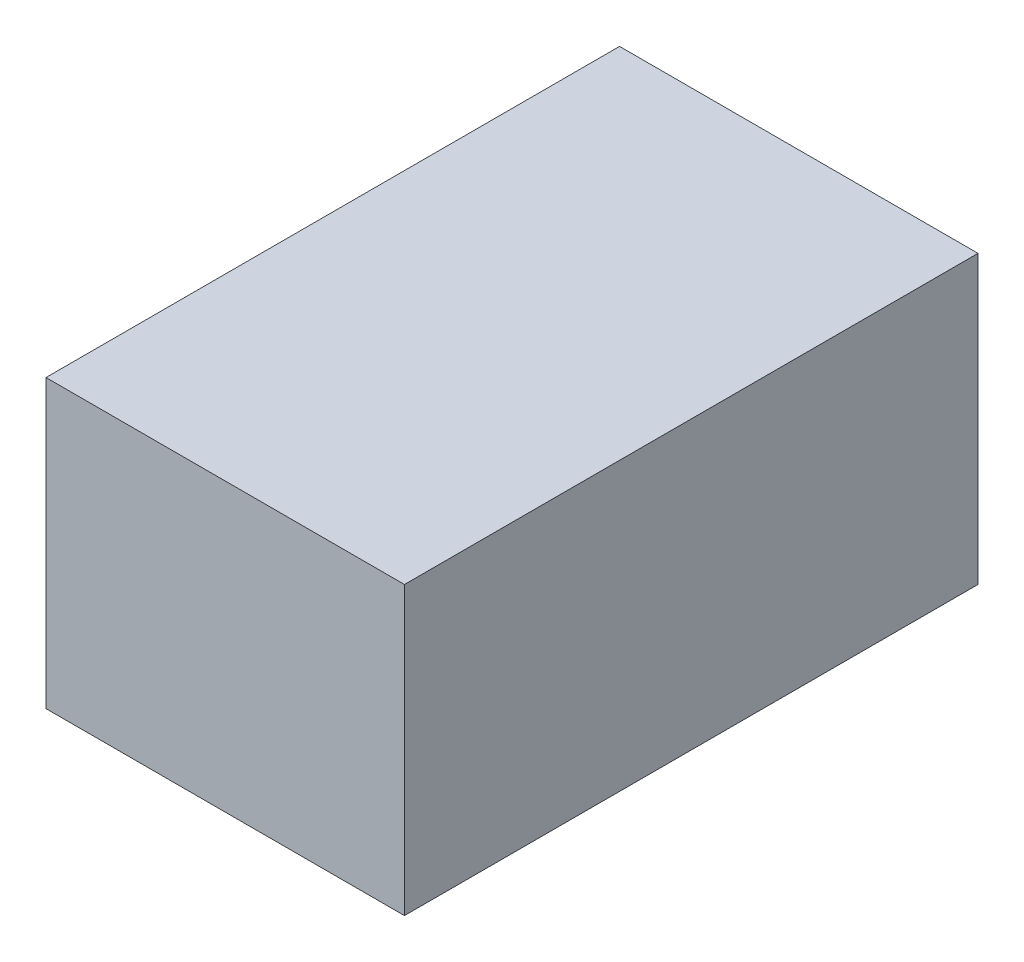
ISO-10303-21;
HEADER;
FILE_DESCRIPTION(('STEP AP214'),'2;1');
FILE_NAME('part.step','',(''),(''),'','','');
FILE_SCHEMA(('AUTOMOTIVE_DESIGN { 1 0 10303 214 1 1 1 1 }'));
ENDSEC;
DATA;
#1=APPLICATION_CONTEXT('core data for automotive mechanical design processes');
#2=APPLICATION_PROTOCOL_DEFINITION('international standard','automotive_design',2000,#1);
#3=PRODUCT_CONTEXT('',#1,'mechanical');
#4=PRODUCT('Part','Part','',(#3));
#5=PRODUCT_RELATED_PRODUCT_CATEGORY('part','',(#4));
#6=PRODUCT_DEFINITION_FORMATION('','',#4);
#7=PRODUCT_DEFINITION_CONTEXT('part definition',#1,'design');
#8=PRODUCT_DEFINITION('design','',#6,#7);
#9=PRODUCT_DEFINITION_SHAPE('','',#8);
#10=(LENGTH_UNIT() NAMED_UNIT(*) SI_UNIT(.MILLI.,.METRE.));
#11=(NAMED_UNIT(*) PLANE_ANGLE_UNIT() SI_UNIT($,.RADIAN.));
#12=(NAMED_UNIT(*) SI_UNIT($,.STERADIAN.) SOLID_ANGLE_UNIT());
#13=UNCERTAINTY_MEASURE_WITH_UNIT(LENGTH_MEASURE(1.E-05),#10,'distance_accuracy_value','');
#14=(GEOMETRIC_REPRESENTATION_CONTEXT(3) GLOBAL_UNCERTAINTY_ASSIGNED_CONTEXT((#13)) GLOBAL_UNIT_ASSIGNED_CONTEXT((#10,
#11,#12)) REPRESENTATION_CONTEXT('',''));
#15=CARTESIAN_POINT('',(0.,0.,0.));
#16=DIRECTION('',(0.,0.,1.));
#17=DIRECTION('',(1.,0.,0.));
#18=AXIS2_PLACEMENT_3D('',#15,#16,#17);
#19=CARTESIAN_POINT('',(0.,0.,-50.8));
#20=DIRECTION('',(-1.,0.,0.));
#21=DIRECTION('',(0.,0.,1.));
#22=AXIS2_PLACEMENT_3D('',#19,#20,#21);
#23=PLANE('',#22);
#24=DIRECTION('',(0.,-1.,0.));
#25=VECTOR('',#24,1.);
#26=CARTESIAN_POINT('',(0.,0.,0.));
#27=LINE('',#26,#25);
#28=CARTESIAN_POINT('',(0.,25.4,0.));
#29=VERTEX_POINT('',#28);
#30=CARTESIAN_POINT('',(0.,0.,0.));
#31=VERTEX_POINT('',#30);
#32=EDGE_CURVE('E96',#29,#31,#27,.T.);
#33=ORIENTED_EDGE('',*,*,#32,.F.);
#34=DIRECTION('',(0.,0.,1.));
#35=VECTOR('',#34,1.);
#36=CARTESIAN_POINT('',(0.,25.4,-50.8));
#37=LINE('',#36,#35);
#38=CARTESIAN_POINT('',(0.,25.4,-50.8));
#39=VERTEX_POINT('',#38);
#40=EDGE_CURVE('E11',#39,#29,#37,.T.);
#41=ORIENTED_EDGE('',*,*,#40,.F.);
#42=DIRECTION('',(0.,-1.,0.));
#43=VECTOR('',#42,1.);
#44=CARTESIAN_POINT('',(0.,0.,-50.8));
#45=LINE('',#44,#43);
#46=CARTESIAN_POINT('',(0.,0.,-50.8));
#47=VERTEX_POINT('',#46);
#48=EDGE_CURVE('E90',#39,#47,#45,.T.);
#49=ORIENTED_EDGE('',*,*,#48,.T.);
#50=DIRECTION('',(0.,0.,1.));
#51=VECTOR('',#50,1.);
#52=CARTESIAN_POINT('',(0.,0.,-50.8));
#53=LINE('',#52,#51);
#54=EDGE_CURVE('E35',#47,#31,#53,.T.);
#55=ORIENTED_EDGE('',*,*,#54,.T.);
#56=EDGE_LOOP('',(#33,#41,#49,#55));
#57=FACE_BOUND('',#56,.T.);
#58=ADVANCED_FACE('F32',(#57),#23,.T.);
#59=CARTESIAN_POINT('',(0.,25.4,-50.8));
#60=DIRECTION('',(0.,1.,0.));
#61=DIRECTION('',(0.,0.,1.));
#62=AXIS2_PLACEMENT_3D('',#59,#60,#61);
#63=PLANE('',#62);
#64=DIRECTION('',(-1.,0.,0.));
#65=VECTOR('',#64,1.);
#66=CARTESIAN_POINT('',(0.,25.4,0.));
#67=LINE('',#66,#65);
#68=CARTESIAN_POINT('',(31.75,25.4,0.));
#69=VERTEX_POINT('',#68);
#70=EDGE_CURVE('E92',#69,#29,#67,.T.);
#71=ORIENTED_EDGE('',*,*,#70,.F.);
#72=DIRECTION('',(0.,0.,1.));
#73=VECTOR('',#72,1.);
#74=CARTESIAN_POINT('',(31.75,25.4,-50.8));
#75=LINE('',#74,#73);
#76=CARTESIAN_POINT('',(31.75,25.4,-50.8));
#77=VERTEX_POINT('',#76);
#78=EDGE_CURVE('E41',#77,#69,#75,.T.);
#79=ORIENTED_EDGE('',*,*,#78,.F.);
#80=DIRECTION('',(-1.,0.,0.));
#81=VECTOR('',#80,1.);
#82=CARTESIAN_POINT('',(0.,25.4,-50.8));
#83=LINE('',#82,#81);
#84=EDGE_CURVE('E87',#77,#39,#83,.T.);
#85=ORIENTED_EDGE('',*,*,#84,.T.);
#86=ORIENTED_EDGE('',*,*,#40,.T.);
#87=EDGE_LOOP('',(#71,#79,#85,#86));
#88=FACE_BOUND('',#87,.T.);
#89=ADVANCED_FACE('F106',(#88),#63,.T.);
#90=CARTESIAN_POINT('',(31.75,0.,-50.8));
#91=DIRECTION('',(1.,0.,0.));
#92=DIRECTION('',(0.,0.,-1.));
#93=AXIS2_PLACEMENT_3D('',#90,#91,#92);
#94=PLANE('',#93);
#95=DIRECTION('',(0.,1.,0.));
#96=VECTOR('',#95,1.);
#97=CARTESIAN_POINT('',(31.75,0.,0.));
#98=LINE('',#97,#96);
#99=CARTESIAN_POINT('',(31.75,0.,0.));
#100=VERTEX_POINT('',#99);
#101=EDGE_CURVE('E82',#100,#69,#98,.T.);
#102=ORIENTED_EDGE('',*,*,#101,.F.);
#103=DIRECTION('',(0.,0.,1.));
#104=VECTOR('',#103,1.);
#105=CARTESIAN_POINT('',(31.75,0.,-50.8));
#106=LINE('',#105,#104);
#107=CARTESIAN_POINT('',(31.75,0.,-50.8));
#108=VERTEX_POINT('',#107);
#109=EDGE_CURVE('E77',#108,#100,#106,.T.);
#110=ORIENTED_EDGE('',*,*,#109,.F.);
#111=DIRECTION('',(0.,1.,0.));
#112=VECTOR('',#111,1.);
#113=CARTESIAN_POINT('',(31.75,0.,-50.8));
#114=LINE('',#113,#112);
#115=EDGE_CURVE('E80',#108,#77,#114,.T.);
#116=ORIENTED_EDGE('',*,*,#115,.T.);
#117=ORIENTED_EDGE('',*,*,#78,.T.);
#118=EDGE_LOOP('',(#102,#110,#116,#117));
#119=FACE_BOUND('',#118,.T.);
#120=ADVANCED_FACE('F79',(#119),#94,.T.);
#121=CARTESIAN_POINT('',(0.,0.,-50.8));
#122=DIRECTION('',(0.,-1.,0.));
#123=DIRECTION('',(0.,0.,-1.));
#124=AXIS2_PLACEMENT_3D('',#121,#122,#123);
#125=PLANE('',#124);
#126=DIRECTION('',(1.,0.,0.));
#127=VECTOR('',#126,1.);
#128=CARTESIAN_POINT('',(0.,0.,0.));
#129=LINE('',#128,#127);
#130=EDGE_CURVE('E99',#31,#100,#129,.T.);
#131=ORIENTED_EDGE('',*,*,#130,.F.);
#132=ORIENTED_EDGE('',*,*,#54,.F.);
#133=DIRECTION('',(1.,0.,0.));
#134=VECTOR('',#133,1.);
#135=CARTESIAN_POINT('',(0.,0.,-50.8));
#136=LINE('',#135,#134);
#137=EDGE_CURVE('E86',#47,#108,#136,.T.);
#138=ORIENTED_EDGE('',*,*,#137,.T.);
#139=ORIENTED_EDGE('',*,*,#109,.T.);
#140=EDGE_LOOP('',(#131,#132,#138,#139));
#141=FACE_BOUND('',#140,.T.);
#142=ADVANCED_FACE('F89',(#141),#125,.T.);
#143=CARTESIAN_POINT('',(0.,0.,-50.8));
#144=DIRECTION('',(0.,0.,-1.));
#145=DIRECTION('',(-1.,0.,0.));
#146=AXIS2_PLACEMENT_3D('',#143,#144,#145);
#147=PLANE('',#146);
#148=ORIENTED_EDGE('',*,*,#48,.F.);
#149=ORIENTED_EDGE('',*,*,#84,.F.);
#150=ORIENTED_EDGE('',*,*,#115,.F.);
#151=ORIENTED_EDGE('',*,*,#137,.F.);
#152=EDGE_LOOP('',(#148,#149,#150,#151));
#153=FACE_BOUND('',#152,.T.);
#154=ADVANCED_FACE('F85',(#153),#147,.T.);
#155=CARTESIAN_POINT('',(0.,0.,0.));
#156=DIRECTION('',(0.,0.,-1.));
#157=DIRECTION('',(-1.,0.,0.));
#158=AXIS2_PLACEMENT_3D('',#155,#156,#157);
#159=PLANE('',#158);
#160=ORIENTED_EDGE('',*,*,#32,.T.);
#161=ORIENTED_EDGE('',*,*,#130,.T.);
#162=ORIENTED_EDGE('',*,*,#101,.T.);
#163=ORIENTED_EDGE('',*,*,#70,.T.);
#164=EDGE_LOOP('',(#160,#161,#162,#163));
#165=FACE_BOUND('',#164,.T.);
#166=ADVANCED_FACE('F105',(#165),#159,.F.);
#167=CLOSED_SHELL('',(#58,#89,#120,#142,#154,#166));
#168=MANIFOLD_SOLID_BREP('B2',#167);
#169=ADVANCED_BREP_SHAPE_REPRESENTATION('',(#18,#168),#14);
#170=SHAPE_DEFINITION_REPRESENTATION(#9,#169);
ENDSEC;
END-ISO-10303-21;
